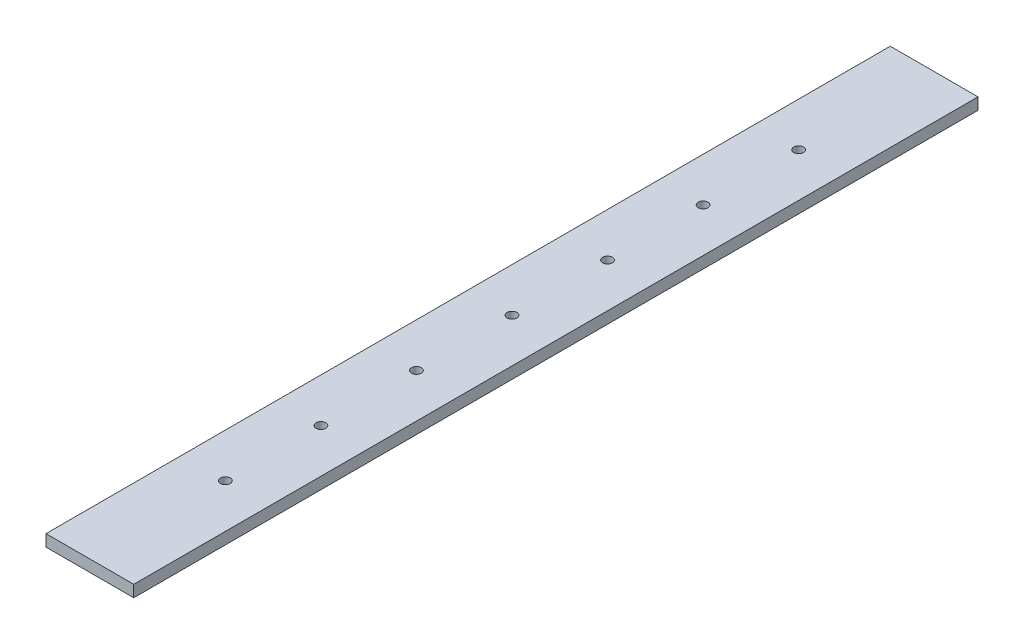
ISO-10303-21;
HEADER;
FILE_DESCRIPTION(('STEP AP214'),'2;1');
FILE_NAME('part.step','',(''),(''),'','','');
FILE_SCHEMA(('AUTOMOTIVE_DESIGN { 1 0 10303 214 1 1 1 1 }'));
ENDSEC;
DATA;
#1=APPLICATION_CONTEXT('core data for automotive mechanical design processes');
#2=APPLICATION_PROTOCOL_DEFINITION('international standard','automotive_design',2000,#1);
#3=PRODUCT_CONTEXT('',#1,'mechanical');
#4=PRODUCT('Part','Part','',(#3));
#5=PRODUCT_RELATED_PRODUCT_CATEGORY('part','',(#4));
#6=PRODUCT_DEFINITION_FORMATION('','',#4);
#7=PRODUCT_DEFINITION_CONTEXT('part definition',#1,'design');
#8=PRODUCT_DEFINITION('design','',#6,#7);
#9=PRODUCT_DEFINITION_SHAPE('','',#8);
#10=(LENGTH_UNIT() NAMED_UNIT(*) SI_UNIT(.MILLI.,.METRE.));
#11=(NAMED_UNIT(*) PLANE_ANGLE_UNIT() SI_UNIT($,.RADIAN.));
#12=(NAMED_UNIT(*) SI_UNIT($,.STERADIAN.) SOLID_ANGLE_UNIT());
#13=UNCERTAINTY_MEASURE_WITH_UNIT(LENGTH_MEASURE(1.E-05),#10,'distance_accuracy_value','');
#14=(GEOMETRIC_REPRESENTATION_CONTEXT(3) GLOBAL_UNCERTAINTY_ASSIGNED_CONTEXT((#13)) GLOBAL_UNIT_ASSIGNED_CONTEXT((#10,
#11,#12)) REPRESENTATION_CONTEXT('',''));
#15=CARTESIAN_POINT('',(0.,0.,0.));
#16=DIRECTION('',(0.,0.,1.));
#17=DIRECTION('',(1.,0.,0.));
#18=AXIS2_PLACEMENT_3D('',#15,#16,#17);
#19=CARTESIAN_POINT('',(0.,38.1,0.));
#20=DIRECTION('',(1.,0.,0.));
#21=DIRECTION('',(0.,0.,-1.));
#22=AXIS2_PLACEMENT_3D('',#19,#20,#21);
#23=PLANE('',#22);
#24=DIRECTION('',(0.,0.,1.));
#25=VECTOR('',#24,1.);
#26=CARTESIAN_POINT('',(0.,0.,0.));
#27=LINE('',#26,#25);
#28=CARTESIAN_POINT('',(0.,0.,0.));
#29=VERTEX_POINT('',#28);
#30=CARTESIAN_POINT('',(3.3672276065956E-13,0.,2749.55));
#31=VERTEX_POINT('',#30);
#32=EDGE_CURVE('E95',#29,#31,#27,.T.);
#33=ORIENTED_EDGE('',*,*,#32,.T.);
#34=DIRECTION('',(0.,-1.,0.));
#35=VECTOR('',#34,1.);
#36=CARTESIAN_POINT('',(3.3672276065956E-13,38.1,2749.55));
#37=LINE('',#36,#35);
#38=CARTESIAN_POINT('',(3.3672276065956E-13,38.1,2749.55));
#39=VERTEX_POINT('',#38);
#40=EDGE_CURVE('E11',#39,#31,#37,.T.);
#41=ORIENTED_EDGE('',*,*,#40,.F.);
#42=DIRECTION('',(0.,0.,1.));
#43=VECTOR('',#42,1.);
#44=CARTESIAN_POINT('',(0.,38.1,0.));
#45=LINE('',#44,#43);
#46=CARTESIAN_POINT('',(0.,38.1,0.));
#47=VERTEX_POINT('',#46);
#48=EDGE_CURVE('E83',#47,#39,#45,.T.);
#49=ORIENTED_EDGE('',*,*,#48,.F.);
#50=DIRECTION('',(0.,-1.,0.));
#51=VECTOR('',#50,1.);
#52=CARTESIAN_POINT('',(0.,38.1,0.));
#53=LINE('',#52,#51);
#54=EDGE_CURVE('E91',#47,#29,#53,.T.);
#55=ORIENTED_EDGE('',*,*,#54,.T.);
#56=EDGE_LOOP('',(#33,#41,#49,#55));
#57=FACE_BOUND('',#56,.T.);
#58=ADVANCED_FACE('F32',(#57),#23,.F.);
#59=CARTESIAN_POINT('',(3.3672276065956E-13,38.1,2749.55));
#60=DIRECTION('',(0.,0.,-1.));
#61=DIRECTION('',(-1.,0.,0.));
#62=AXIS2_PLACEMENT_3D('',#59,#60,#61);
#63=PLANE('',#62);
#64=DIRECTION('',(1.,0.,0.));
#65=VECTOR('',#64,1.);
#66=CARTESIAN_POINT('',(3.3672276065956E-13,0.,2749.55));
#67=LINE('',#66,#65);
#68=CARTESIAN_POINT('',(285.75,0.,2749.55));
#69=VERTEX_POINT('',#68);
#70=EDGE_CURVE('E87',#31,#69,#67,.T.);
#71=ORIENTED_EDGE('',*,*,#70,.T.);
#72=DIRECTION('',(0.,-1.,0.));
#73=VECTOR('',#72,1.);
#74=CARTESIAN_POINT('',(285.75,38.1,2749.55));
#75=LINE('',#74,#73);
#76=CARTESIAN_POINT('',(285.75,38.1,2749.55));
#77=VERTEX_POINT('',#76);
#78=EDGE_CURVE('E40',#77,#69,#75,.T.);
#79=ORIENTED_EDGE('',*,*,#78,.F.);
#80=DIRECTION('',(1.,0.,0.));
#81=VECTOR('',#80,1.);
#82=CARTESIAN_POINT('',(3.3672276065956E-13,38.1,2749.55));
#83=LINE('',#82,#81);
#84=EDGE_CURVE('E78',#39,#77,#83,.T.);
#85=ORIENTED_EDGE('',*,*,#84,.F.);
#86=ORIENTED_EDGE('',*,*,#40,.T.);
#87=EDGE_LOOP('',(#71,#79,#85,#86));
#88=FACE_BOUND('',#87,.T.);
#89=ADVANCED_FACE('F86',(#88),#63,.F.);
#90=CARTESIAN_POINT('',(285.75,38.1,0.));
#91=DIRECTION('',(-1.,0.,0.));
#92=DIRECTION('',(0.,0.,1.));
#93=AXIS2_PLACEMENT_3D('',#90,#91,#92);
#94=PLANE('',#93);
#95=DIRECTION('',(0.,0.,-1.));
#96=VECTOR('',#95,1.);
#97=CARTESIAN_POINT('',(285.75,0.,0.));
#98=LINE('',#97,#96);
#99=CARTESIAN_POINT('',(285.75,0.,0.));
#100=VERTEX_POINT('',#99);
#101=EDGE_CURVE('E65',#69,#100,#98,.T.);
#102=ORIENTED_EDGE('',*,*,#101,.T.);
#103=DIRECTION('',(0.,-1.,0.));
#104=VECTOR('',#103,1.);
#105=CARTESIAN_POINT('',(285.75,38.1,0.));
#106=LINE('',#105,#104);
#107=CARTESIAN_POINT('',(285.75,38.1,0.));
#108=VERTEX_POINT('',#107);
#109=EDGE_CURVE('E88',#108,#100,#106,.T.);
#110=ORIENTED_EDGE('',*,*,#109,.F.);
#111=DIRECTION('',(0.,0.,-1.));
#112=VECTOR('',#111,1.);
#113=CARTESIAN_POINT('',(285.75,38.1,0.));
#114=LINE('',#113,#112);
#115=EDGE_CURVE('E81',#77,#108,#114,.T.);
#116=ORIENTED_EDGE('',*,*,#115,.F.);
#117=ORIENTED_EDGE('',*,*,#78,.T.);
#118=EDGE_LOOP('',(#102,#110,#116,#117));
#119=FACE_BOUND('',#118,.T.);
#120=ADVANCED_FACE('F89',(#119),#94,.F.);
#121=CARTESIAN_POINT('',(0.,38.1,0.));
#122=DIRECTION('',(0.,0.,1.));
#123=DIRECTION('',(1.,0.,0.));
#124=AXIS2_PLACEMENT_3D('',#121,#122,#123);
#125=PLANE('',#124);
#126=DIRECTION('',(-1.,0.,0.));
#127=VECTOR('',#126,1.);
#128=CARTESIAN_POINT('',(0.,0.,0.));
#129=LINE('',#128,#127);
#130=EDGE_CURVE('E71',#100,#29,#129,.T.);
#131=ORIENTED_EDGE('',*,*,#130,.T.);
#132=ORIENTED_EDGE('',*,*,#54,.F.);
#133=DIRECTION('',(-1.,0.,0.));
#134=VECTOR('',#133,1.);
#135=CARTESIAN_POINT('',(0.,38.1,0.));
#136=LINE('',#135,#134);
#137=EDGE_CURVE('E48',#108,#47,#136,.T.);
#138=ORIENTED_EDGE('',*,*,#137,.F.);
#139=ORIENTED_EDGE('',*,*,#109,.T.);
#140=EDGE_LOOP('',(#131,#132,#138,#139));
#141=FACE_BOUND('',#140,.T.);
#142=ADVANCED_FACE('F103',(#141),#125,.F.);
#143=CARTESIAN_POINT('',(0.,38.1,0.));
#144=DIRECTION('',(0.,1.,0.));
#145=DIRECTION('',(0.,0.,1.));
#146=AXIS2_PLACEMENT_3D('',#143,#144,#145);
#147=PLANE('',#146);
#148=CARTESIAN_POINT('',(142.875,38.1,441.325));
#149=DIRECTION('',(0.,1.,0.));
#150=DIRECTION('',(0.,0.,1.));
#151=AXIS2_PLACEMENT_3D('',#148,#149,#150);
#152=CIRCLE('',#151,15.875);
#153=CARTESIAN_POINT('',(142.875,38.1,457.199999999999));
#154=VERTEX_POINT('',#153);
#155=EDGE_CURVE('E115',#154,#154,#152,.T.);
#156=ORIENTED_EDGE('',*,*,#155,.F.);
#157=EDGE_LOOP('',(#156));
#158=FACE_BOUND('',#157,.T.);
#159=CARTESIAN_POINT('',(142.875,38.1,752.475));
#160=DIRECTION('',(0.,1.,0.));
#161=DIRECTION('',(0.,0.,1.));
#162=AXIS2_PLACEMENT_3D('',#159,#160,#161);
#163=CIRCLE('',#162,15.875);
#164=CARTESIAN_POINT('',(142.875,38.1,768.35));
#165=VERTEX_POINT('',#164);
#166=EDGE_CURVE('E121',#165,#165,#163,.T.);
#167=ORIENTED_EDGE('',*,*,#166,.F.);
#168=EDGE_LOOP('',(#167));
#169=FACE_BOUND('',#168,.T.);
#170=CARTESIAN_POINT('',(142.875,38.1,1063.625));
#171=DIRECTION('',(0.,1.,0.));
#172=DIRECTION('',(0.,0.,1.));
#173=AXIS2_PLACEMENT_3D('',#170,#171,#172);
#174=CIRCLE('',#173,15.875);
#175=CARTESIAN_POINT('',(142.875,38.1,1079.5));
#176=VERTEX_POINT('',#175);
#177=EDGE_CURVE('E127',#176,#176,#174,.T.);
#178=ORIENTED_EDGE('',*,*,#177,.F.);
#179=EDGE_LOOP('',(#178));
#180=FACE_BOUND('',#179,.T.);
#181=CARTESIAN_POINT('',(142.875,38.1,1374.775));
#182=DIRECTION('',(0.,1.,0.));
#183=DIRECTION('',(0.,0.,1.));
#184=AXIS2_PLACEMENT_3D('',#181,#182,#183);
#185=CIRCLE('',#184,15.8750000000001);
#186=CARTESIAN_POINT('',(142.875,38.1,1390.65));
#187=VERTEX_POINT('',#186);
#188=EDGE_CURVE('E133',#187,#187,#185,.T.);
#189=ORIENTED_EDGE('',*,*,#188,.F.);
#190=EDGE_LOOP('',(#189));
#191=FACE_BOUND('',#190,.T.);
#192=CARTESIAN_POINT('',(142.875,38.1,1685.925));
#193=DIRECTION('',(0.,1.,0.));
#194=DIRECTION('',(0.,0.,1.));
#195=AXIS2_PLACEMENT_3D('',#192,#193,#194);
#196=CIRCLE('',#195,15.8750000000001);
#197=CARTESIAN_POINT('',(142.875,38.1,1701.8));
#198=VERTEX_POINT('',#197);
#199=EDGE_CURVE('E139',#198,#198,#196,.T.);
#200=ORIENTED_EDGE('',*,*,#199,.F.);
#201=EDGE_LOOP('',(#200));
#202=FACE_BOUND('',#201,.T.);
#203=CARTESIAN_POINT('',(142.875,38.1,2308.225));
#204=DIRECTION('',(0.,1.,0.));
#205=DIRECTION('',(0.,0.,1.));
#206=AXIS2_PLACEMENT_3D('',#203,#204,#205);
#207=CIRCLE('',#206,15.8749999999998);
#208=CARTESIAN_POINT('',(142.875,38.1,2324.1));
#209=VERTEX_POINT('',#208);
#210=EDGE_CURVE('E145',#209,#209,#207,.T.);
#211=ORIENTED_EDGE('',*,*,#210,.F.);
#212=EDGE_LOOP('',(#211));
#213=FACE_BOUND('',#212,.T.);
#214=CARTESIAN_POINT('',(142.875,38.1,1997.075));
#215=DIRECTION('',(0.,1.,0.));
#216=DIRECTION('',(0.,0.,1.));
#217=AXIS2_PLACEMENT_3D('',#214,#215,#216);
#218=CIRCLE('',#217,15.8750000000001);
#219=CARTESIAN_POINT('',(142.875,38.1,2012.95));
#220=VERTEX_POINT('',#219);
#221=EDGE_CURVE('E109',#220,#220,#218,.T.);
#222=ORIENTED_EDGE('',*,*,#221,.F.);
#223=EDGE_LOOP('',(#222));
#224=FACE_BOUND('',#223,.T.);
#225=ORIENTED_EDGE('',*,*,#48,.T.);
#226=ORIENTED_EDGE('',*,*,#84,.T.);
#227=ORIENTED_EDGE('',*,*,#115,.T.);
#228=ORIENTED_EDGE('',*,*,#137,.T.);
#229=EDGE_LOOP('',(#225,#226,#227,#228));
#230=FACE_BOUND('',#229,.T.);
#231=ADVANCED_FACE('F79',(#158,#169,#180,#191,#202,#213,#224,#230),#147,.T.);
#232=CARTESIAN_POINT('',(0.,0.,0.));
#233=DIRECTION('',(0.,1.,0.));
#234=DIRECTION('',(0.,0.,1.));
#235=AXIS2_PLACEMENT_3D('',#232,#233,#234);
#236=PLANE('',#235);
#237=CARTESIAN_POINT('',(142.875,0.,441.325));
#238=DIRECTION('',(0.,1.,0.));
#239=DIRECTION('',(0.,0.,1.));
#240=AXIS2_PLACEMENT_3D('',#237,#238,#239);
#241=CIRCLE('',#240,15.875);
#242=CARTESIAN_POINT('',(142.875,0.,457.199999999999));
#243=VERTEX_POINT('',#242);
#244=EDGE_CURVE('E118',#243,#243,#241,.T.);
#245=ORIENTED_EDGE('',*,*,#244,.T.);
#246=EDGE_LOOP('',(#245));
#247=FACE_BOUND('',#246,.T.);
#248=CARTESIAN_POINT('',(142.875,0.,752.475));
#249=DIRECTION('',(0.,1.,0.));
#250=DIRECTION('',(0.,0.,1.));
#251=AXIS2_PLACEMENT_3D('',#248,#249,#250);
#252=CIRCLE('',#251,15.875);
#253=CARTESIAN_POINT('',(142.875,0.,768.35));
#254=VERTEX_POINT('',#253);
#255=EDGE_CURVE('E124',#254,#254,#252,.T.);
#256=ORIENTED_EDGE('',*,*,#255,.T.);
#257=EDGE_LOOP('',(#256));
#258=FACE_BOUND('',#257,.T.);
#259=CARTESIAN_POINT('',(142.875,0.,1063.625));
#260=DIRECTION('',(0.,1.,0.));
#261=DIRECTION('',(0.,0.,1.));
#262=AXIS2_PLACEMENT_3D('',#259,#260,#261);
#263=CIRCLE('',#262,15.875);
#264=CARTESIAN_POINT('',(142.875,0.,1079.5));
#265=VERTEX_POINT('',#264);
#266=EDGE_CURVE('E130',#265,#265,#263,.T.);
#267=ORIENTED_EDGE('',*,*,#266,.T.);
#268=EDGE_LOOP('',(#267));
#269=FACE_BOUND('',#268,.T.);
#270=CARTESIAN_POINT('',(142.875,0.,1374.775));
#271=DIRECTION('',(0.,1.,0.));
#272=DIRECTION('',(0.,0.,1.));
#273=AXIS2_PLACEMENT_3D('',#270,#271,#272);
#274=CIRCLE('',#273,15.8750000000001);
#275=CARTESIAN_POINT('',(142.875,0.,1390.65));
#276=VERTEX_POINT('',#275);
#277=EDGE_CURVE('E136',#276,#276,#274,.T.);
#278=ORIENTED_EDGE('',*,*,#277,.T.);
#279=EDGE_LOOP('',(#278));
#280=FACE_BOUND('',#279,.T.);
#281=CARTESIAN_POINT('',(142.875,0.,1685.925));
#282=DIRECTION('',(0.,1.,0.));
#283=DIRECTION('',(0.,0.,1.));
#284=AXIS2_PLACEMENT_3D('',#281,#282,#283);
#285=CIRCLE('',#284,15.8750000000001);
#286=CARTESIAN_POINT('',(142.875,0.,1701.8));
#287=VERTEX_POINT('',#286);
#288=EDGE_CURVE('E142',#287,#287,#285,.T.);
#289=ORIENTED_EDGE('',*,*,#288,.T.);
#290=EDGE_LOOP('',(#289));
#291=FACE_BOUND('',#290,.T.);
#292=CARTESIAN_POINT('',(142.875,0.,2308.225));
#293=DIRECTION('',(0.,1.,0.));
#294=DIRECTION('',(0.,0.,1.));
#295=AXIS2_PLACEMENT_3D('',#292,#293,#294);
#296=CIRCLE('',#295,15.8749999999998);
#297=CARTESIAN_POINT('',(142.875,0.,2324.1));
#298=VERTEX_POINT('',#297);
#299=EDGE_CURVE('E112',#298,#298,#296,.T.);
#300=ORIENTED_EDGE('',*,*,#299,.T.);
#301=EDGE_LOOP('',(#300));
#302=FACE_BOUND('',#301,.T.);
#303=CARTESIAN_POINT('',(142.875,0.,1997.075));
#304=DIRECTION('',(0.,1.,0.));
#305=DIRECTION('',(0.,0.,1.));
#306=AXIS2_PLACEMENT_3D('',#303,#304,#305);
#307=CIRCLE('',#306,15.8750000000001);
#308=CARTESIAN_POINT('',(142.875,0.,2012.95));
#309=VERTEX_POINT('',#308);
#310=EDGE_CURVE('E98',#309,#309,#307,.T.);
#311=ORIENTED_EDGE('',*,*,#310,.T.);
#312=EDGE_LOOP('',(#311));
#313=FACE_BOUND('',#312,.T.);
#314=ORIENTED_EDGE('',*,*,#32,.F.);
#315=ORIENTED_EDGE('',*,*,#130,.F.);
#316=ORIENTED_EDGE('',*,*,#101,.F.);
#317=ORIENTED_EDGE('',*,*,#70,.F.);
#318=EDGE_LOOP('',(#314,#315,#316,#317));
#319=FACE_BOUND('',#318,.T.);
#320=ADVANCED_FACE('F106',(#247,#258,#269,#280,#291,#302,#313,#319),#236,.F.);
#321=CARTESIAN_POINT('',(142.875,0.,1997.075));
#322=DIRECTION('',(0.,1.,0.));
#323=DIRECTION('',(0.,0.,1.));
#324=AXIS2_PLACEMENT_3D('',#321,#322,#323);
#325=CYLINDRICAL_SURFACE('',#324,15.8750000000001);
#326=ORIENTED_EDGE('',*,*,#310,.F.);
#327=EDGE_LOOP('',(#326));
#328=FACE_BOUND('',#327,.T.);
#329=ORIENTED_EDGE('',*,*,#221,.T.);
#330=EDGE_LOOP('',(#329));
#331=FACE_BOUND('',#330,.T.);
#332=ADVANCED_FACE('F157',(#328,#331),#325,.F.);
#333=CARTESIAN_POINT('',(142.875,0.,2308.225));
#334=DIRECTION('',(0.,1.,0.));
#335=DIRECTION('',(0.,0.,1.));
#336=AXIS2_PLACEMENT_3D('',#333,#334,#335);
#337=CYLINDRICAL_SURFACE('',#336,15.8749999999998);
#338=ORIENTED_EDGE('',*,*,#299,.F.);
#339=EDGE_LOOP('',(#338));
#340=FACE_BOUND('',#339,.T.);
#341=ORIENTED_EDGE('',*,*,#210,.T.);
#342=EDGE_LOOP('',(#341));
#343=FACE_BOUND('',#342,.T.);
#344=ADVANCED_FACE('F153',(#340,#343),#337,.F.);
#345=CARTESIAN_POINT('',(142.875,0.,1685.925));
#346=DIRECTION('',(0.,1.,0.));
#347=DIRECTION('',(0.,0.,1.));
#348=AXIS2_PLACEMENT_3D('',#345,#346,#347);
#349=CYLINDRICAL_SURFACE('',#348,15.8750000000001);
#350=ORIENTED_EDGE('',*,*,#288,.F.);
#351=EDGE_LOOP('',(#350));
#352=FACE_BOUND('',#351,.T.);
#353=ORIENTED_EDGE('',*,*,#199,.T.);
#354=EDGE_LOOP('',(#353));
#355=FACE_BOUND('',#354,.T.);
#356=ADVANCED_FACE('F156',(#352,#355),#349,.F.);
#357=CARTESIAN_POINT('',(142.875,0.,1374.775));
#358=DIRECTION('',(0.,1.,0.));
#359=DIRECTION('',(0.,0.,1.));
#360=AXIS2_PLACEMENT_3D('',#357,#358,#359);
#361=CYLINDRICAL_SURFACE('',#360,15.8750000000001);
#362=ORIENTED_EDGE('',*,*,#277,.F.);
#363=EDGE_LOOP('',(#362));
#364=FACE_BOUND('',#363,.T.);
#365=ORIENTED_EDGE('',*,*,#188,.T.);
#366=EDGE_LOOP('',(#365));
#367=FACE_BOUND('',#366,.T.);
#368=ADVANCED_FACE('F218',(#364,#367),#361,.F.);
#369=CARTESIAN_POINT('',(142.875,0.,1063.625));
#370=DIRECTION('',(0.,1.,0.));
#371=DIRECTION('',(0.,0.,1.));
#372=AXIS2_PLACEMENT_3D('',#369,#370,#371);
#373=CYLINDRICAL_SURFACE('',#372,15.875);
#374=ORIENTED_EDGE('',*,*,#266,.F.);
#375=EDGE_LOOP('',(#374));
#376=FACE_BOUND('',#375,.T.);
#377=ORIENTED_EDGE('',*,*,#177,.T.);
#378=EDGE_LOOP('',(#377));
#379=FACE_BOUND('',#378,.T.);
#380=ADVANCED_FACE('F228',(#376,#379),#373,.F.);
#381=CARTESIAN_POINT('',(142.875,0.,752.475));
#382=DIRECTION('',(0.,1.,0.));
#383=DIRECTION('',(0.,0.,1.));
#384=AXIS2_PLACEMENT_3D('',#381,#382,#383);
#385=CYLINDRICAL_SURFACE('',#384,15.875);
#386=ORIENTED_EDGE('',*,*,#255,.F.);
#387=EDGE_LOOP('',(#386));
#388=FACE_BOUND('',#387,.T.);
#389=ORIENTED_EDGE('',*,*,#166,.T.);
#390=EDGE_LOOP('',(#389));
#391=FACE_BOUND('',#390,.T.);
#392=ADVANCED_FACE('F238',(#388,#391),#385,.F.);
#393=CARTESIAN_POINT('',(142.875,0.,441.325));
#394=DIRECTION('',(0.,1.,0.));
#395=DIRECTION('',(0.,0.,1.));
#396=AXIS2_PLACEMENT_3D('',#393,#394,#395);
#397=CYLINDRICAL_SURFACE('',#396,15.875);
#398=ORIENTED_EDGE('',*,*,#244,.F.);
#399=EDGE_LOOP('',(#398));
#400=FACE_BOUND('',#399,.T.);
#401=ORIENTED_EDGE('',*,*,#155,.T.);
#402=EDGE_LOOP('',(#401));
#403=FACE_BOUND('',#402,.T.);
#404=ADVANCED_FACE('F248',(#400,#403),#397,.F.);
#405=CLOSED_SHELL('',(#58,#89,#120,#142,#231,#320,#332,#344,#356,#368,#380,#392,#404));
#406=MANIFOLD_SOLID_BREP('B2',#405);
#407=ADVANCED_BREP_SHAPE_REPRESENTATION('',(#18,#406),#14);
#408=SHAPE_DEFINITION_REPRESENTATION(#9,#407);
ENDSEC;
END-ISO-10303-21;
